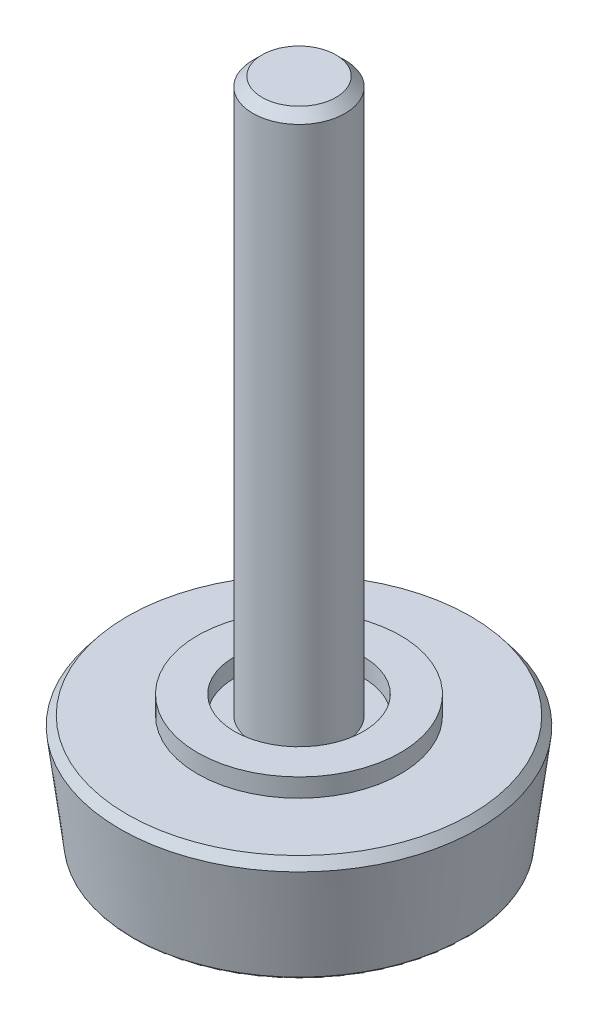
ISO-10303-21;
HEADER;
FILE_DESCRIPTION(('STEP AP214'),'2;1');
FILE_NAME('part.step','',(''),(''),'','','');
FILE_SCHEMA(('AUTOMOTIVE_DESIGN { 1 0 10303 214 1 1 1 1 }'));
ENDSEC;
DATA;
#1=APPLICATION_CONTEXT('core data for automotive mechanical design processes');
#2=APPLICATION_PROTOCOL_DEFINITION('international standard','automotive_design',2000,#1);
#3=PRODUCT_CONTEXT('',#1,'mechanical');
#4=PRODUCT('Part','Part','',(#3));
#5=PRODUCT_RELATED_PRODUCT_CATEGORY('part','',(#4));
#6=PRODUCT_DEFINITION_FORMATION('','',#4);
#7=PRODUCT_DEFINITION_CONTEXT('part definition',#1,'design');
#8=PRODUCT_DEFINITION('design','',#6,#7);
#9=PRODUCT_DEFINITION_SHAPE('','',#8);
#10=(LENGTH_UNIT() NAMED_UNIT(*) SI_UNIT(.MILLI.,.METRE.));
#11=(NAMED_UNIT(*) PLANE_ANGLE_UNIT() SI_UNIT($,.RADIAN.));
#12=(NAMED_UNIT(*) SI_UNIT($,.STERADIAN.) SOLID_ANGLE_UNIT());
#13=UNCERTAINTY_MEASURE_WITH_UNIT(LENGTH_MEASURE(1.E-05),#10,'distance_accuracy_value','');
#14=(GEOMETRIC_REPRESENTATION_CONTEXT(3) GLOBAL_UNCERTAINTY_ASSIGNED_CONTEXT((#13)) GLOBAL_UNIT_ASSIGNED_CONTEXT((#10,
#11,#12)) REPRESENTATION_CONTEXT('',''));
#15=CARTESIAN_POINT('',(0.,0.,0.));
#16=DIRECTION('',(0.,0.,1.));
#17=DIRECTION('',(1.,0.,0.));
#18=AXIS2_PLACEMENT_3D('',#15,#16,#17);
#19=CARTESIAN_POINT('',(0.,6.,0.));
#20=DIRECTION('',(0.,1.,0.));
#21=DIRECTION('',(0.,0.,1.));
#22=AXIS2_PLACEMENT_3D('',#19,#20,#21);
#23=PLANE('',#22);
#24=CARTESIAN_POINT('',(0.,6.,0.));
#25=DIRECTION('',(0.,1.,0.));
#26=DIRECTION('',(0.,0.,1.));
#27=AXIS2_PLACEMENT_3D('',#24,#25,#26);
#28=CIRCLE('',#27,9.3020967917612);
#29=CARTESIAN_POINT('',(0.,6.,9.3020967917612));
#30=VERTEX_POINT('',#29);
#31=EDGE_CURVE('E37',#30,#30,#28,.T.);
#32=ORIENTED_EDGE('',*,*,#31,.T.);
#33=EDGE_LOOP('',(#32));
#34=FACE_BOUND('',#33,.T.);
#35=CARTESIAN_POINT('',(0.,6.,0.));
#36=DIRECTION('',(0.,1.,0.));
#37=DIRECTION('',(0.,0.,1.));
#38=AXIS2_PLACEMENT_3D('',#35,#36,#37);
#39=CIRCLE('',#38,5.5);
#40=CARTESIAN_POINT('',(0.,6.,5.5));
#41=VERTEX_POINT('',#40);
#42=EDGE_CURVE('E44',#41,#41,#39,.T.);
#43=ORIENTED_EDGE('',*,*,#42,.F.);
#44=EDGE_LOOP('',(#43));
#45=FACE_BOUND('',#44,.T.);
#46=ADVANCED_FACE('F14',(#34,#45),#23,.T.);
#47=CARTESIAN_POINT('',(0.,0.,0.));
#48=DIRECTION('',(0.,1.,0.));
#49=DIRECTION('',(0.,0.,1.));
#50=AXIS2_PLACEMENT_3D('',#47,#48,#49);
#51=PLANE('',#50);
#52=CARTESIAN_POINT('',(0.,0.,0.));
#53=DIRECTION('',(0.,1.,0.));
#54=DIRECTION('',(0.,0.,1.));
#55=AXIS2_PLACEMENT_3D('',#52,#53,#54);
#56=CIRCLE('',#55,8.91172177814627);
#57=CARTESIAN_POINT('',(0.,0.,8.91172177814627));
#58=VERTEX_POINT('',#57);
#59=EDGE_CURVE('E9',#58,#58,#56,.F.);
#60=ORIENTED_EDGE('',*,*,#59,.T.);
#61=EDGE_LOOP('',(#60));
#62=FACE_BOUND('',#61,.T.);
#63=ADVANCED_FACE('F79',(#62),#51,.F.);
#64=CARTESIAN_POINT('',(0.,0.,0.));
#65=DIRECTION('',(0.,1.,0.));
#66=DIRECTION('',(0.,0.,1.));
#67=AXIS2_PLACEMENT_3D('',#64,#65,#66);
#68=CONICAL_SURFACE('',#67,9.,0.124354994546762);
#69=CARTESIAN_POINT('',(0.,0.0875965265410793,0.));
#70=DIRECTION('',(0.,1.,0.));
#71=DIRECTION('',(0.,0.,1.));
#72=AXIS2_PLACEMENT_3D('',#69,#70,#71);
#73=CIRCLE('',#72,9.01094956581764);
#74=CARTESIAN_POINT('',(0.,0.0875965265410793,9.01094956581764));
#75=VERTEX_POINT('',#74);
#76=EDGE_CURVE('E21',#75,#75,#73,.T.);
#77=ORIENTED_EDGE('',*,*,#76,.T.);
#78=EDGE_LOOP('',(#77));
#79=FACE_BOUND('',#78,.T.);
#80=CARTESIAN_POINT('',(0.,5.50386106164318,0.));
#81=DIRECTION('',(0.,-1.,0.));
#82=DIRECTION('',(0.,0.,-1.));
#83=AXIS2_PLACEMENT_3D('',#80,#81,#82);
#84=CIRCLE('',#83,9.6879826327054);
#85=CARTESIAN_POINT('',(0.,5.50386106164318,-9.6879826327054));
#86=VERTEX_POINT('',#85);
#87=EDGE_CURVE('E34',#86,#86,#84,.T.);
#88=ORIENTED_EDGE('',*,*,#87,.T.);
#89=EDGE_LOOP('',(#88));
#90=FACE_BOUND('',#89,.T.);
#91=ADVANCED_FACE('F84',(#79,#90),#68,.T.);
#92=CARTESIAN_POINT('',(0.,7.,0.));
#93=DIRECTION('',(0.,1.,0.));
#94=DIRECTION('',(0.,0.,1.));
#95=AXIS2_PLACEMENT_3D('',#92,#93,#94);
#96=PLANE('',#95);
#97=CARTESIAN_POINT('',(0.,7.,0.));
#98=DIRECTION('',(0.,1.,0.));
#99=DIRECTION('',(0.,0.,1.));
#100=AXIS2_PLACEMENT_3D('',#97,#98,#99);
#101=CIRCLE('',#100,5.5);
#102=CARTESIAN_POINT('',(0.,7.,5.5));
#103=VERTEX_POINT('',#102);
#104=EDGE_CURVE('E43',#103,#103,#101,.T.);
#105=ORIENTED_EDGE('',*,*,#104,.T.);
#106=EDGE_LOOP('',(#105));
#107=FACE_BOUND('',#106,.T.);
#108=CARTESIAN_POINT('',(0.,7.,0.));
#109=DIRECTION('',(0.,1.,0.));
#110=DIRECTION('',(0.,0.,1.));
#111=AXIS2_PLACEMENT_3D('',#108,#109,#110);
#112=CIRCLE('',#111,3.5);
#113=CARTESIAN_POINT('',(0.,7.,3.5));
#114=VERTEX_POINT('',#113);
#115=EDGE_CURVE('E47',#114,#114,#112,.T.);
#116=ORIENTED_EDGE('',*,*,#115,.F.);
#117=EDGE_LOOP('',(#116));
#118=FACE_BOUND('',#117,.T.);
#119=ADVANCED_FACE('F73',(#107,#118),#96,.T.);
#120=CARTESIAN_POINT('',(0.,7.,0.));
#121=DIRECTION('',(0.,-1.,0.));
#122=DIRECTION('',(0.,0.,-1.));
#123=AXIS2_PLACEMENT_3D('',#120,#121,#122);
#124=CYLINDRICAL_SURFACE('',#123,5.5);
#125=ORIENTED_EDGE('',*,*,#104,.F.);
#126=EDGE_LOOP('',(#125));
#127=FACE_BOUND('',#126,.T.);
#128=ORIENTED_EDGE('',*,*,#42,.T.);
#129=EDGE_LOOP('',(#128));
#130=FACE_BOUND('',#129,.T.);
#131=ADVANCED_FACE('F66',(#127,#130),#124,.T.);
#132=CARTESIAN_POINT('',(0.,7.,0.));
#133=DIRECTION('',(0.,-1.,0.));
#134=DIRECTION('',(0.,0.,-1.));
#135=AXIS2_PLACEMENT_3D('',#132,#133,#134);
#136=CYLINDRICAL_SURFACE('',#135,3.5);
#137=ORIENTED_EDGE('',*,*,#115,.T.);
#138=EDGE_LOOP('',(#137));
#139=FACE_BOUND('',#138,.T.);
#140=CARTESIAN_POINT('',(0.,6.,0.));
#141=DIRECTION('',(0.,1.,0.));
#142=DIRECTION('',(0.,0.,1.));
#143=AXIS2_PLACEMENT_3D('',#140,#141,#142);
#144=CIRCLE('',#143,3.5);
#145=CARTESIAN_POINT('',(0.,6.,3.5));
#146=VERTEX_POINT('',#145);
#147=EDGE_CURVE('E40',#146,#146,#144,.F.);
#148=ORIENTED_EDGE('',*,*,#147,.T.);
#149=EDGE_LOOP('',(#148));
#150=FACE_BOUND('',#149,.T.);
#151=ADVANCED_FACE('F61',(#139,#150),#136,.F.);
#152=CARTESIAN_POINT('',(0.,6.,0.));
#153=DIRECTION('',(0.,1.,0.));
#154=DIRECTION('',(0.,0.,1.));
#155=AXIS2_PLACEMENT_3D('',#152,#153,#154);
#156=CIRCLE('',#155,2.5);
#157=CARTESIAN_POINT('',(0.,6.,2.5));
#158=VERTEX_POINT('',#157);
#159=EDGE_CURVE('E52',#158,#158,#156,.T.);
#160=ORIENTED_EDGE('',*,*,#159,.F.);
#161=EDGE_LOOP('',(#160));
#162=FACE_BOUND('',#161,.T.);
#163=ORIENTED_EDGE('',*,*,#147,.F.);
#164=EDGE_LOOP('',(#163));
#165=FACE_BOUND('',#164,.T.);
#166=ADVANCED_FACE('F58',(#162,#165),#23,.T.);
#167=CARTESIAN_POINT('',(0.,36.,0.));
#168=DIRECTION('',(0.,-1.,0.));
#169=DIRECTION('',(0.,0.,-1.));
#170=AXIS2_PLACEMENT_3D('',#167,#168,#169);
#171=CYLINDRICAL_SURFACE('',#170,2.5);
#172=CARTESIAN_POINT('',(0.,35.5,0.));
#173=DIRECTION('',(0.,1.,0.));
#174=DIRECTION('',(0.,0.,1.));
#175=AXIS2_PLACEMENT_3D('',#172,#173,#174);
#176=CIRCLE('',#175,2.5);
#177=CARTESIAN_POINT('',(0.,35.5,2.5));
#178=VERTEX_POINT('',#177);
#179=EDGE_CURVE('E25',#178,#178,#176,.F.);
#180=ORIENTED_EDGE('',*,*,#179,.T.);
#181=EDGE_LOOP('',(#180));
#182=FACE_BOUND('',#181,.T.);
#183=ORIENTED_EDGE('',*,*,#159,.T.);
#184=EDGE_LOOP('',(#183));
#185=FACE_BOUND('',#184,.T.);
#186=ADVANCED_FACE('F56',(#182,#185),#171,.T.);
#187=CARTESIAN_POINT('',(0.,36.,0.));
#188=DIRECTION('',(0.,1.,0.));
#189=DIRECTION('',(0.,0.,1.));
#190=AXIS2_PLACEMENT_3D('',#187,#188,#189);
#191=PLANE('',#190);
#192=CARTESIAN_POINT('',(0.,36.,0.));
#193=DIRECTION('',(0.,1.,0.));
#194=DIRECTION('',(0.,0.,1.));
#195=AXIS2_PLACEMENT_3D('',#192,#193,#194);
#196=CIRCLE('',#195,1.99999999999999);
#197=CARTESIAN_POINT('',(0.,36.,1.99999999999999));
#198=VERTEX_POINT('',#197);
#199=EDGE_CURVE('E29',#198,#198,#196,.T.);
#200=ORIENTED_EDGE('',*,*,#199,.T.);
#201=EDGE_LOOP('',(#200));
#202=FACE_BOUND('',#201,.T.);
#203=ADVANCED_FACE('F97',(#202),#191,.T.);
#204=CARTESIAN_POINT('',(0.,6.,0.));
#205=DIRECTION('',(0.,-1.,0.));
#206=DIRECTION('',(0.,0.,-1.));
#207=AXIS2_PLACEMENT_3D('',#204,#205,#206);
#208=CONICAL_SURFACE('',#207,9.3020967917612,0.661043168850686);
#209=ORIENTED_EDGE('',*,*,#87,.F.);
#210=EDGE_LOOP('',(#209));
#211=FACE_BOUND('',#210,.T.);
#212=ORIENTED_EDGE('',*,*,#31,.F.);
#213=EDGE_LOOP('',(#212));
#214=FACE_BOUND('',#213,.T.);
#215=ADVANCED_FACE('F90',(#211,#214),#208,.T.);
#216=CARTESIAN_POINT('',(0.,36.,0.));
#217=DIRECTION('',(0.,-1.,0.));
#218=DIRECTION('',(0.,0.,-1.));
#219=AXIS2_PLACEMENT_3D('',#216,#217,#218);
#220=CONICAL_SURFACE('',#219,1.99999999999999,0.785398163397446);
#221=ORIENTED_EDGE('',*,*,#179,.F.);
#222=EDGE_LOOP('',(#221));
#223=FACE_BOUND('',#222,.T.);
#224=ORIENTED_EDGE('',*,*,#199,.F.);
#225=EDGE_LOOP('',(#224));
#226=FACE_BOUND('',#225,.T.);
#227=ADVANCED_FACE('F96',(#223,#226),#220,.T.);
#228=CARTESIAN_POINT('',(0.,0.1,0.));
#229=DIRECTION('',(0.,1.,0.));
#230=DIRECTION('',(0.,0.,1.));
#231=AXIS2_PLACEMENT_3D('',#228,#229,#230);
#232=TOROIDAL_SURFACE('',#231,8.91172177814627,0.1);
#233=ORIENTED_EDGE('',*,*,#59,.F.);
#234=EDGE_LOOP('',(#233));
#235=FACE_BOUND('',#234,.T.);
#236=ORIENTED_EDGE('',*,*,#76,.F.);
#237=EDGE_LOOP('',(#236));
#238=FACE_BOUND('',#237,.T.);
#239=ADVANCED_FACE('F16',(#235,#238),#232,.T.);
#240=CLOSED_SHELL('',(#46,#63,#91,#119,#131,#151,#166,#186,#203,#215,#227,#239));
#241=MANIFOLD_SOLID_BREP('B1',#240);
#242=ADVANCED_BREP_SHAPE_REPRESENTATION('',(#18,#241),#14);
#243=SHAPE_DEFINITION_REPRESENTATION(#9,#242);
ENDSEC;
END-ISO-10303-21;
